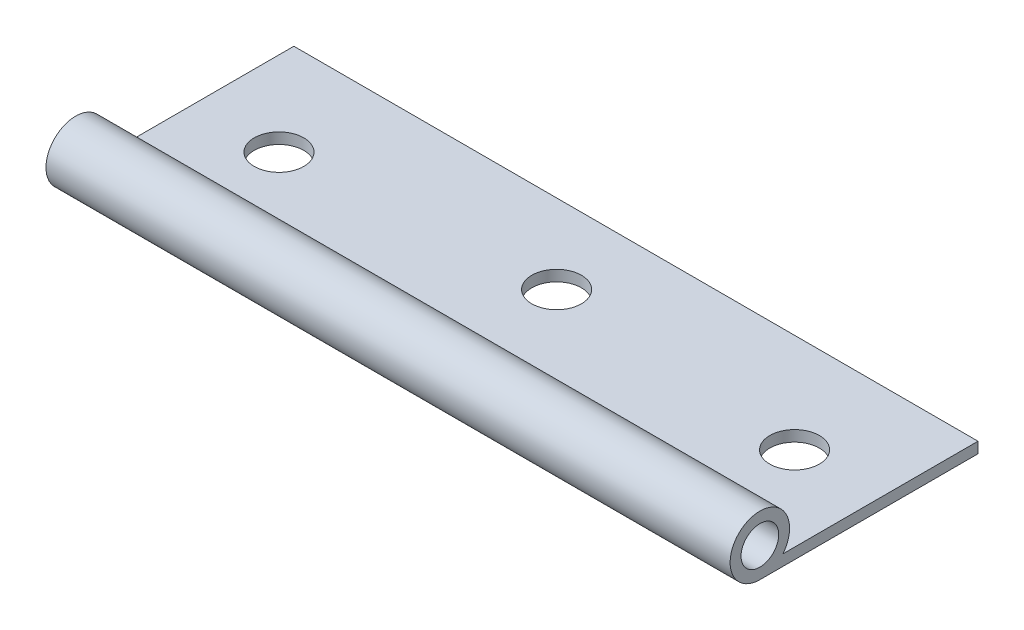
ISO-10303-21;
HEADER;
FILE_DESCRIPTION(('STEP AP214'),'2;1');
FILE_NAME('part.step','',(''),(''),'','','');
FILE_SCHEMA(('AUTOMOTIVE_DESIGN { 1 0 10303 214 1 1 1 1 }'));
ENDSEC;
DATA;
#1=APPLICATION_CONTEXT('core data for automotive mechanical design processes');
#2=APPLICATION_PROTOCOL_DEFINITION('international standard','automotive_design',2000,#1);
#3=PRODUCT_CONTEXT('',#1,'mechanical');
#4=PRODUCT('Part','Part','',(#3));
#5=PRODUCT_RELATED_PRODUCT_CATEGORY('part','',(#4));
#6=PRODUCT_DEFINITION_FORMATION('','',#4);
#7=PRODUCT_DEFINITION_CONTEXT('part definition',#1,'design');
#8=PRODUCT_DEFINITION('design','',#6,#7);
#9=PRODUCT_DEFINITION_SHAPE('','',#8);
#10=(LENGTH_UNIT() NAMED_UNIT(*) SI_UNIT(.MILLI.,.METRE.));
#11=(NAMED_UNIT(*) PLANE_ANGLE_UNIT() SI_UNIT($,.RADIAN.));
#12=(NAMED_UNIT(*) SI_UNIT($,.STERADIAN.) SOLID_ANGLE_UNIT());
#13=UNCERTAINTY_MEASURE_WITH_UNIT(LENGTH_MEASURE(1.E-05),#10,'distance_accuracy_value','');
#14=(GEOMETRIC_REPRESENTATION_CONTEXT(3) GLOBAL_UNCERTAINTY_ASSIGNED_CONTEXT((#13)) GLOBAL_UNIT_ASSIGNED_CONTEXT((#10,
#11,#12)) REPRESENTATION_CONTEXT('',''));
#15=CARTESIAN_POINT('',(0.,0.,0.));
#16=DIRECTION('',(0.,0.,1.));
#17=DIRECTION('',(1.,0.,0.));
#18=AXIS2_PLACEMENT_3D('',#15,#16,#17);
#19=CARTESIAN_POINT('',(69.,1.9,3.));
#20=DIRECTION('',(1.,0.,0.));
#21=DIRECTION('',(0.,0.,-1.));
#22=AXIS2_PLACEMENT_3D('',#19,#20,#21);
#23=PLANE('',#22);
#24=DIRECTION('',(0.,0.,1.));
#25=VECTOR('',#24,1.);
#26=CARTESIAN_POINT('',(69.,0.,0.));
#27=LINE('',#26,#25);
#28=CARTESIAN_POINT('',(69.,0.,-19.));
#29=VERTEX_POINT('',#28);
#30=CARTESIAN_POINT('',(69.,0.,0.678362646751216));
#31=VERTEX_POINT('',#30);
#32=EDGE_CURVE('E51',#29,#31,#27,.T.);
#33=ORIENTED_EDGE('',*,*,#32,.T.);
#34=CARTESIAN_POINT('',(69.,1.9,3.));
#35=DIRECTION('',(1.,0.,0.));
#36=DIRECTION('',(0.,0.,-1.));
#37=AXIS2_PLACEMENT_3D('',#34,#35,#36);
#38=CIRCLE('',#37,3.);
#39=CARTESIAN_POINT('',(69.,-1.1,3.));
#40=VERTEX_POINT('',#39);
#41=EDGE_CURVE('E81',#31,#40,#38,.T.);
#42=ORIENTED_EDGE('',*,*,#41,.T.);
#43=DIRECTION('',(0.,0.,-1.));
#44=VECTOR('',#43,1.);
#45=CARTESIAN_POINT('',(69.,-1.1,0.));
#46=LINE('',#45,#44);
#47=CARTESIAN_POINT('',(69.,-1.1,-19.));
#48=VERTEX_POINT('',#47);
#49=EDGE_CURVE('E85',#40,#48,#46,.T.);
#50=ORIENTED_EDGE('',*,*,#49,.T.);
#51=DIRECTION('',(0.,1.,0.));
#52=VECTOR('',#51,1.);
#53=CARTESIAN_POINT('',(69.,0.,-19.));
#54=LINE('',#53,#52);
#55=EDGE_CURVE('E93',#48,#29,#54,.T.);
#56=ORIENTED_EDGE('',*,*,#55,.T.);
#57=EDGE_LOOP('',(#33,#42,#50,#56));
#58=FACE_BOUND('',#57,.T.);
#59=CARTESIAN_POINT('',(69.,1.9,3.));
#60=DIRECTION('',(1.,0.,0.));
#61=DIRECTION('',(0.,0.,-1.));
#62=AXIS2_PLACEMENT_3D('',#59,#60,#61);
#63=CIRCLE('',#62,1.9);
#64=CARTESIAN_POINT('',(69.,1.9,1.1));
#65=VERTEX_POINT('',#64);
#66=EDGE_CURVE('E100',#65,#65,#63,.T.);
#67=ORIENTED_EDGE('',*,*,#66,.F.);
#68=EDGE_LOOP('',(#67));
#69=FACE_BOUND('',#68,.T.);
#70=ADVANCED_FACE('F34',(#58,#69),#23,.T.);
#71=CARTESIAN_POINT('',(0.,1.9,3.));
#72=DIRECTION('',(1.,0.,0.));
#73=DIRECTION('',(0.,0.,-1.));
#74=AXIS2_PLACEMENT_3D('',#71,#72,#73);
#75=PLANE('',#74);
#76=CARTESIAN_POINT('',(0.,1.9,3.));
#77=DIRECTION('',(1.,0.,0.));
#78=DIRECTION('',(0.,0.,-1.));
#79=AXIS2_PLACEMENT_3D('',#76,#77,#78);
#80=CIRCLE('',#79,3.);
#81=CARTESIAN_POINT('',(0.,0.,0.678362646751216));
#82=VERTEX_POINT('',#81);
#83=CARTESIAN_POINT('',(0.,-1.1,3.));
#84=VERTEX_POINT('',#83);
#85=EDGE_CURVE('E89',#82,#84,#80,.T.);
#86=ORIENTED_EDGE('',*,*,#85,.F.);
#87=DIRECTION('',(0.,0.,1.));
#88=VECTOR('',#87,1.);
#89=CARTESIAN_POINT('',(0.,0.,0.));
#90=LINE('',#89,#88);
#91=CARTESIAN_POINT('',(0.,0.,-19.));
#92=VERTEX_POINT('',#91);
#93=EDGE_CURVE('E103',#92,#82,#90,.T.);
#94=ORIENTED_EDGE('',*,*,#93,.F.);
#95=DIRECTION('',(0.,1.,0.));
#96=VECTOR('',#95,1.);
#97=CARTESIAN_POINT('',(0.,0.,-19.));
#98=LINE('',#97,#96);
#99=CARTESIAN_POINT('',(0.,-1.1,-19.));
#100=VERTEX_POINT('',#99);
#101=EDGE_CURVE('E75',#100,#92,#98,.T.);
#102=ORIENTED_EDGE('',*,*,#101,.F.);
#103=DIRECTION('',(0.,0.,-1.));
#104=VECTOR('',#103,1.);
#105=CARTESIAN_POINT('',(0.,-1.1,-19.));
#106=LINE('',#105,#104);
#107=EDGE_CURVE('E68',#84,#100,#106,.T.);
#108=ORIENTED_EDGE('',*,*,#107,.F.);
#109=EDGE_LOOP('',(#86,#94,#102,#108));
#110=FACE_BOUND('',#109,.T.);
#111=CARTESIAN_POINT('',(0.,1.9,3.));
#112=DIRECTION('',(1.,0.,0.));
#113=DIRECTION('',(0.,0.,-1.));
#114=AXIS2_PLACEMENT_3D('',#111,#112,#113);
#115=CIRCLE('',#114,1.9);
#116=CARTESIAN_POINT('',(0.,1.9,1.1));
#117=VERTEX_POINT('',#116);
#118=EDGE_CURVE('E164',#117,#117,#115,.T.);
#119=ORIENTED_EDGE('',*,*,#118,.T.);
#120=EDGE_LOOP('',(#119));
#121=FACE_BOUND('',#120,.T.);
#122=ADVANCED_FACE('F109',(#110,#121),#75,.F.);
#123=CARTESIAN_POINT('',(69.,1.9,3.));
#124=DIRECTION('',(-1.,0.,0.));
#125=DIRECTION('',(0.,0.,1.));
#126=AXIS2_PLACEMENT_3D('',#123,#124,#125);
#127=CYLINDRICAL_SURFACE('',#126,3.);
#128=ORIENTED_EDGE('',*,*,#85,.T.);
#129=DIRECTION('',(-1.,0.,0.));
#130=VECTOR('',#129,1.);
#131=CARTESIAN_POINT('',(69.,-1.1,3.));
#132=LINE('',#131,#130);
#133=EDGE_CURVE('E43',#40,#84,#132,.T.);
#134=ORIENTED_EDGE('',*,*,#133,.F.);
#135=ORIENTED_EDGE('',*,*,#41,.F.);
#136=DIRECTION('',(-1.,0.,0.));
#137=VECTOR('',#136,1.);
#138=CARTESIAN_POINT('',(69.,0.,0.678362646751216));
#139=LINE('',#138,#137);
#140=EDGE_CURVE('E11',#31,#82,#139,.T.);
#141=ORIENTED_EDGE('',*,*,#140,.T.);
#142=EDGE_LOOP('',(#128,#134,#135,#141));
#143=FACE_BOUND('',#142,.T.);
#144=ADVANCED_FACE('F36',(#143),#127,.T.);
#145=CARTESIAN_POINT('',(69.,-1.1,-19.));
#146=DIRECTION('',(0.,1.,0.));
#147=DIRECTION('',(0.,0.,1.));
#148=AXIS2_PLACEMENT_3D('',#145,#146,#147);
#149=PLANE('',#148);
#150=CARTESIAN_POINT('',(60.5,-1.1,-9.00000000000001));
#151=DIRECTION('',(0.,1.,0.));
#152=DIRECTION('',(0.,0.,-1.));
#153=AXIS2_PLACEMENT_3D('',#150,#151,#152);
#154=CIRCLE('',#153,2.50000000000002);
#155=CARTESIAN_POINT('',(60.5,-1.1,-11.5));
#156=VERTEX_POINT('',#155);
#157=EDGE_CURVE('E148',#156,#156,#154,.T.);
#158=ORIENTED_EDGE('',*,*,#157,.T.);
#159=EDGE_LOOP('',(#158));
#160=FACE_BOUND('',#159,.T.);
#161=CARTESIAN_POINT('',(34.5,-1.1,-11.));
#162=DIRECTION('',(0.,1.,0.));
#163=DIRECTION('',(0.,0.,1.));
#164=AXIS2_PLACEMENT_3D('',#161,#162,#163);
#165=CIRCLE('',#164,2.5);
#166=CARTESIAN_POINT('',(34.5,-1.1,-8.5));
#167=VERTEX_POINT('',#166);
#168=EDGE_CURVE('E151',#167,#167,#165,.T.);
#169=ORIENTED_EDGE('',*,*,#168,.T.);
#170=EDGE_LOOP('',(#169));
#171=FACE_BOUND('',#170,.T.);
#172=CARTESIAN_POINT('',(8.5,-1.1,-9.));
#173=DIRECTION('',(0.,1.,0.));
#174=DIRECTION('',(0.,0.,1.));
#175=AXIS2_PLACEMENT_3D('',#172,#173,#174);
#176=CIRCLE('',#175,2.5);
#177=CARTESIAN_POINT('',(8.5,-1.1,-6.5));
#178=VERTEX_POINT('',#177);
#179=EDGE_CURVE('E161',#178,#178,#176,.T.);
#180=ORIENTED_EDGE('',*,*,#179,.T.);
#181=EDGE_LOOP('',(#180));
#182=FACE_BOUND('',#181,.T.);
#183=ORIENTED_EDGE('',*,*,#107,.T.);
#184=DIRECTION('',(-1.,0.,0.));
#185=VECTOR('',#184,1.);
#186=CARTESIAN_POINT('',(69.,-1.1,-19.));
#187=LINE('',#186,#185);
#188=EDGE_CURVE('E90',#48,#100,#187,.T.);
#189=ORIENTED_EDGE('',*,*,#188,.F.);
#190=ORIENTED_EDGE('',*,*,#49,.F.);
#191=ORIENTED_EDGE('',*,*,#133,.T.);
#192=EDGE_LOOP('',(#183,#189,#190,#191));
#193=FACE_BOUND('',#192,.T.);
#194=ADVANCED_FACE('F91',(#160,#171,#182,#193),#149,.F.);
#195=CARTESIAN_POINT('',(69.,0.,-19.));
#196=DIRECTION('',(0.,0.,1.));
#197=DIRECTION('',(1.,0.,0.));
#198=AXIS2_PLACEMENT_3D('',#195,#196,#197);
#199=PLANE('',#198);
#200=ORIENTED_EDGE('',*,*,#101,.T.);
#201=DIRECTION('',(-1.,0.,0.));
#202=VECTOR('',#201,1.);
#203=CARTESIAN_POINT('',(69.,0.,-19.));
#204=LINE('',#203,#202);
#205=EDGE_CURVE('E95',#29,#92,#204,.T.);
#206=ORIENTED_EDGE('',*,*,#205,.F.);
#207=ORIENTED_EDGE('',*,*,#55,.F.);
#208=ORIENTED_EDGE('',*,*,#188,.T.);
#209=EDGE_LOOP('',(#200,#206,#207,#208));
#210=FACE_BOUND('',#209,.T.);
#211=ADVANCED_FACE('F106',(#210),#199,.F.);
#212=CARTESIAN_POINT('',(69.,0.,0.));
#213=DIRECTION('',(0.,-1.,0.));
#214=DIRECTION('',(0.,0.,-1.));
#215=AXIS2_PLACEMENT_3D('',#212,#213,#214);
#216=PLANE('',#215);
#217=CARTESIAN_POINT('',(60.5,0.,-9.00000000000001));
#218=DIRECTION('',(0.,1.,0.));
#219=DIRECTION('',(0.,0.,-1.));
#220=AXIS2_PLACEMENT_3D('',#217,#218,#219);
#221=CIRCLE('',#220,2.50000000000002);
#222=CARTESIAN_POINT('',(60.5,0.,-11.5));
#223=VERTEX_POINT('',#222);
#224=EDGE_CURVE('E150',#223,#223,#221,.T.);
#225=ORIENTED_EDGE('',*,*,#224,.F.);
#226=EDGE_LOOP('',(#225));
#227=FACE_BOUND('',#226,.T.);
#228=CARTESIAN_POINT('',(34.5,0.,-11.));
#229=DIRECTION('',(0.,1.,0.));
#230=DIRECTION('',(0.,0.,1.));
#231=AXIS2_PLACEMENT_3D('',#228,#229,#230);
#232=CIRCLE('',#231,2.5);
#233=CARTESIAN_POINT('',(34.5,0.,-8.5));
#234=VERTEX_POINT('',#233);
#235=EDGE_CURVE('E156',#234,#234,#232,.T.);
#236=ORIENTED_EDGE('',*,*,#235,.F.);
#237=EDGE_LOOP('',(#236));
#238=FACE_BOUND('',#237,.T.);
#239=CARTESIAN_POINT('',(8.5,0.,-9.));
#240=DIRECTION('',(0.,1.,0.));
#241=DIRECTION('',(0.,0.,1.));
#242=AXIS2_PLACEMENT_3D('',#239,#240,#241);
#243=CIRCLE('',#242,2.5);
#244=CARTESIAN_POINT('',(8.5,0.,-6.5));
#245=VERTEX_POINT('',#244);
#246=EDGE_CURVE('E153',#245,#245,#243,.T.);
#247=ORIENTED_EDGE('',*,*,#246,.F.);
#248=EDGE_LOOP('',(#247));
#249=FACE_BOUND('',#248,.T.);
#250=ORIENTED_EDGE('',*,*,#93,.T.);
#251=ORIENTED_EDGE('',*,*,#140,.F.);
#252=ORIENTED_EDGE('',*,*,#32,.F.);
#253=ORIENTED_EDGE('',*,*,#205,.T.);
#254=EDGE_LOOP('',(#250,#251,#252,#253));
#255=FACE_BOUND('',#254,.T.);
#256=ADVANCED_FACE('F111',(#227,#238,#249,#255),#216,.F.);
#257=CARTESIAN_POINT('',(69.,1.9,3.));
#258=DIRECTION('',(-1.,0.,0.));
#259=DIRECTION('',(0.,0.,1.));
#260=AXIS2_PLACEMENT_3D('',#257,#258,#259);
#261=CYLINDRICAL_SURFACE('',#260,1.9);
#262=ORIENTED_EDGE('',*,*,#66,.T.);
#263=EDGE_LOOP('',(#262));
#264=FACE_BOUND('',#263,.T.);
#265=ORIENTED_EDGE('',*,*,#118,.F.);
#266=EDGE_LOOP('',(#265));
#267=FACE_BOUND('',#266,.T.);
#268=ADVANCED_FACE('F113',(#264,#267),#261,.F.);
#269=CARTESIAN_POINT('',(8.5,-1.1,-9.));
#270=DIRECTION('',(0.,1.,0.));
#271=DIRECTION('',(0.,0.,1.));
#272=AXIS2_PLACEMENT_3D('',#269,#270,#271);
#273=CYLINDRICAL_SURFACE('',#272,2.5);
#274=ORIENTED_EDGE('',*,*,#179,.F.);
#275=EDGE_LOOP('',(#274));
#276=FACE_BOUND('',#275,.T.);
#277=ORIENTED_EDGE('',*,*,#246,.T.);
#278=EDGE_LOOP('',(#277));
#279=FACE_BOUND('',#278,.T.);
#280=ADVANCED_FACE('F120',(#276,#279),#273,.F.);
#281=CARTESIAN_POINT('',(34.5,-1.1,-11.));
#282=DIRECTION('',(0.,1.,0.));
#283=DIRECTION('',(0.,0.,1.));
#284=AXIS2_PLACEMENT_3D('',#281,#282,#283);
#285=CYLINDRICAL_SURFACE('',#284,2.5);
#286=ORIENTED_EDGE('',*,*,#168,.F.);
#287=EDGE_LOOP('',(#286));
#288=FACE_BOUND('',#287,.T.);
#289=ORIENTED_EDGE('',*,*,#235,.T.);
#290=EDGE_LOOP('',(#289));
#291=FACE_BOUND('',#290,.T.);
#292=ADVANCED_FACE('F135',(#288,#291),#285,.F.);
#293=CARTESIAN_POINT('',(60.5,-1.1,-9.00000000000001));
#294=DIRECTION('',(0.,1.,0.));
#295=DIRECTION('',(0.,0.,1.));
#296=AXIS2_PLACEMENT_3D('',#293,#294,#295);
#297=CYLINDRICAL_SURFACE('',#296,2.50000000000002);
#298=ORIENTED_EDGE('',*,*,#157,.F.);
#299=EDGE_LOOP('',(#298));
#300=FACE_BOUND('',#299,.T.);
#301=ORIENTED_EDGE('',*,*,#224,.T.);
#302=EDGE_LOOP('',(#301));
#303=FACE_BOUND('',#302,.T.);
#304=ADVANCED_FACE('F139',(#300,#303),#297,.F.);
#305=CLOSED_SHELL('',(#70,#122,#144,#194,#211,#256,#268,#280,#292,#304));
#306=MANIFOLD_SOLID_BREP('B2',#305);
#307=ADVANCED_BREP_SHAPE_REPRESENTATION('',(#18,#306),#14);
#308=SHAPE_DEFINITION_REPRESENTATION(#9,#307);
ENDSEC;
END-ISO-10303-21;
